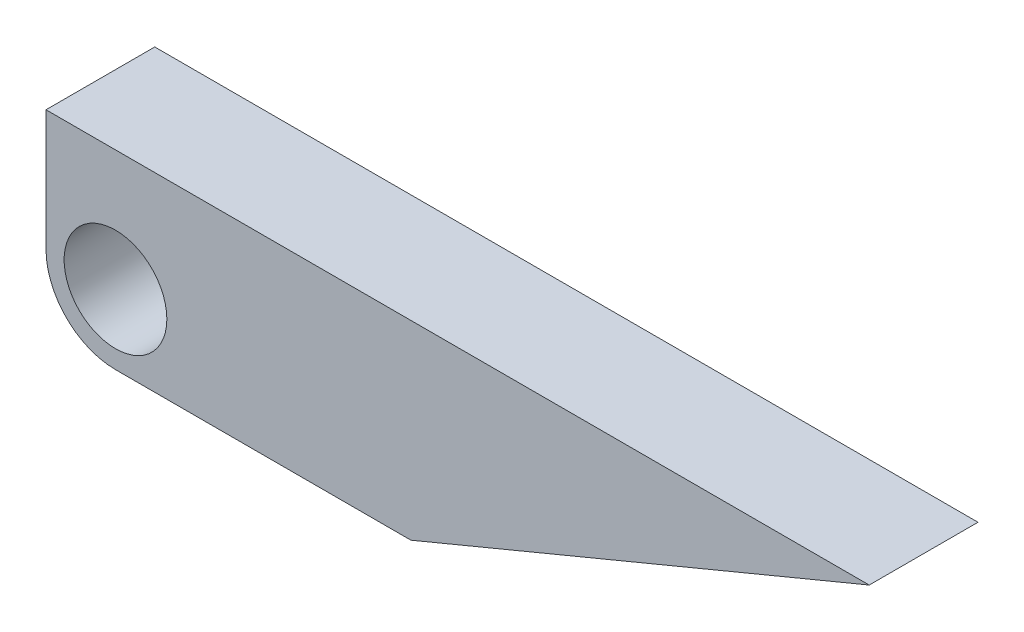
ISO-10303-21;
HEADER;
FILE_DESCRIPTION(('STEP AP214'),'2;1');
FILE_NAME('part.step','',(''),(''),'','','');
FILE_SCHEMA(('AUTOMOTIVE_DESIGN { 1 0 10303 214 1 1 1 1 }'));
ENDSEC;
DATA;
#1=APPLICATION_CONTEXT('core data for automotive mechanical design processes');
#2=APPLICATION_PROTOCOL_DEFINITION('international standard','automotive_design',2000,#1);
#3=PRODUCT_CONTEXT('',#1,'mechanical');
#4=PRODUCT('Part','Part','',(#3));
#5=PRODUCT_RELATED_PRODUCT_CATEGORY('part','',(#4));
#6=PRODUCT_DEFINITION_FORMATION('','',#4);
#7=PRODUCT_DEFINITION_CONTEXT('part definition',#1,'design');
#8=PRODUCT_DEFINITION('design','',#6,#7);
#9=PRODUCT_DEFINITION_SHAPE('','',#8);
#10=(LENGTH_UNIT() NAMED_UNIT(*) SI_UNIT(.MILLI.,.METRE.));
#11=(NAMED_UNIT(*) PLANE_ANGLE_UNIT() SI_UNIT($,.RADIAN.));
#12=(NAMED_UNIT(*) SI_UNIT($,.STERADIAN.) SOLID_ANGLE_UNIT());
#13=UNCERTAINTY_MEASURE_WITH_UNIT(LENGTH_MEASURE(1.E-05),#10,'distance_accuracy_value','');
#14=(GEOMETRIC_REPRESENTATION_CONTEXT(3) GLOBAL_UNCERTAINTY_ASSIGNED_CONTEXT((#13)) GLOBAL_UNIT_ASSIGNED_CONTEXT((#10,
#11,#12)) REPRESENTATION_CONTEXT('',''));
#15=CARTESIAN_POINT('',(0.,0.,0.));
#16=DIRECTION('',(0.,0.,1.));
#17=DIRECTION('',(1.,0.,0.));
#18=AXIS2_PLACEMENT_3D('',#15,#16,#17);
#19=CARTESIAN_POINT('',(-1.15,0.,1.8));
#20=DIRECTION('',(-1.,0.,0.));
#21=DIRECTION('',(0.,0.,1.));
#22=AXIS2_PLACEMENT_3D('',#19,#20,#21);
#23=PLANE('',#22);
#24=DIRECTION('',(0.,1.,0.));
#25=VECTOR('',#24,1.);
#26=CARTESIAN_POINT('',(-1.15,0.,0.));
#27=LINE('',#26,#25);
#28=CARTESIAN_POINT('',(-1.15,0.,0.));
#29=VERTEX_POINT('',#28);
#30=CARTESIAN_POINT('',(-1.15,2.,0.));
#31=VERTEX_POINT('',#30);
#32=EDGE_CURVE('E115',#29,#31,#27,.T.);
#33=ORIENTED_EDGE('',*,*,#32,.F.);
#34=DIRECTION('',(0.,0.,-1.));
#35=VECTOR('',#34,1.);
#36=CARTESIAN_POINT('',(-1.15,0.,1.8));
#37=LINE('',#36,#35);
#38=CARTESIAN_POINT('',(-1.15,0.,1.8));
#39=VERTEX_POINT('',#38);
#40=EDGE_CURVE('E11',#39,#29,#37,.T.);
#41=ORIENTED_EDGE('',*,*,#40,.F.);
#42=DIRECTION('',(0.,1.,0.));
#43=VECTOR('',#42,1.);
#44=CARTESIAN_POINT('',(-1.15,0.,1.8));
#45=LINE('',#44,#43);
#46=CARTESIAN_POINT('',(-1.15,2.,1.8));
#47=VERTEX_POINT('',#46);
#48=EDGE_CURVE('E128',#39,#47,#45,.T.);
#49=ORIENTED_EDGE('',*,*,#48,.T.);
#50=DIRECTION('',(0.,0.,-1.));
#51=VECTOR('',#50,1.);
#52=CARTESIAN_POINT('',(-1.15,2.,1.8));
#53=LINE('',#52,#51);
#54=EDGE_CURVE('E53',#47,#31,#53,.T.);
#55=ORIENTED_EDGE('',*,*,#54,.T.);
#56=EDGE_LOOP('',(#33,#41,#49,#55));
#57=FACE_BOUND('',#56,.T.);
#58=ADVANCED_FACE('F37',(#57),#23,.T.);
#59=CARTESIAN_POINT('',(0.,0.,1.8));
#60=DIRECTION('',(0.,0.,-1.));
#61=DIRECTION('',(-1.,0.,0.));
#62=AXIS2_PLACEMENT_3D('',#59,#60,#61);
#63=CYLINDRICAL_SURFACE('',#62,1.15);
#64=CARTESIAN_POINT('',(0.,0.,0.));
#65=DIRECTION('',(0.,0.,1.));
#66=DIRECTION('',(1.,0.,0.));
#67=AXIS2_PLACEMENT_3D('',#64,#65,#66);
#68=CIRCLE('',#67,1.15);
#69=CARTESIAN_POINT('',(0.,-1.15,0.));
#70=VERTEX_POINT('',#69);
#71=EDGE_CURVE('E117',#29,#70,#68,.T.);
#72=ORIENTED_EDGE('',*,*,#71,.T.);
#73=DIRECTION('',(0.,0.,-1.));
#74=VECTOR('',#73,1.);
#75=CARTESIAN_POINT('',(0.,-1.15,1.8));
#76=LINE('',#75,#74);
#77=CARTESIAN_POINT('',(0.,-1.15,1.8));
#78=VERTEX_POINT('',#77);
#79=EDGE_CURVE('E45',#78,#70,#76,.T.);
#80=ORIENTED_EDGE('',*,*,#79,.F.);
#81=CARTESIAN_POINT('',(0.,0.,1.8));
#82=DIRECTION('',(0.,0.,1.));
#83=DIRECTION('',(1.,0.,0.));
#84=AXIS2_PLACEMENT_3D('',#81,#82,#83);
#85=CIRCLE('',#84,1.15);
#86=EDGE_CURVE('E93',#39,#78,#85,.T.);
#87=ORIENTED_EDGE('',*,*,#86,.F.);
#88=ORIENTED_EDGE('',*,*,#40,.T.);
#89=EDGE_LOOP('',(#72,#80,#87,#88));
#90=FACE_BOUND('',#89,.T.);
#91=ADVANCED_FACE('F147',(#90),#63,.T.);
#92=CARTESIAN_POINT('',(0.,-1.15,1.8));
#93=DIRECTION('',(0.,1.,0.));
#94=DIRECTION('',(0.,0.,1.));
#95=AXIS2_PLACEMENT_3D('',#92,#93,#94);
#96=PLANE('',#95);
#97=DIRECTION('',(1.,0.,0.));
#98=VECTOR('',#97,1.);
#99=CARTESIAN_POINT('',(0.,-1.15,0.));
#100=LINE('',#99,#98);
#101=CARTESIAN_POINT('',(4.88931637616474,-1.15,0.));
#102=VERTEX_POINT('',#101);
#103=EDGE_CURVE('E102',#70,#102,#100,.T.);
#104=ORIENTED_EDGE('',*,*,#103,.T.);
#105=DIRECTION('',(0.,0.,-1.));
#106=VECTOR('',#105,1.);
#107=CARTESIAN_POINT('',(4.88931637616474,-1.15,1.8));
#108=LINE('',#107,#106);
#109=CARTESIAN_POINT('',(4.88931637616474,-1.15,1.8));
#110=VERTEX_POINT('',#109);
#111=EDGE_CURVE('E99',#110,#102,#108,.T.);
#112=ORIENTED_EDGE('',*,*,#111,.F.);
#113=DIRECTION('',(1.,0.,0.));
#114=VECTOR('',#113,1.);
#115=CARTESIAN_POINT('',(0.,-1.15,1.8));
#116=LINE('',#115,#114);
#117=EDGE_CURVE('E85',#78,#110,#116,.T.);
#118=ORIENTED_EDGE('',*,*,#117,.F.);
#119=ORIENTED_EDGE('',*,*,#79,.T.);
#120=EDGE_LOOP('',(#104,#112,#118,#119));
#121=FACE_BOUND('',#120,.T.);
#122=ADVANCED_FACE('F100',(#121),#96,.F.);
#123=CARTESIAN_POINT('',(1.12643137890515,-2.71258198348616,1.8));
#124=DIRECTION('',(-0.383509505898259,0.923536928815342,0.));
#125=DIRECTION('',(-0.923536928815342,-0.383509505898259,0.));
#126=AXIS2_PLACEMENT_3D('',#123,#124,#125);
#127=PLANE('',#126);
#128=DIRECTION('',(0.923536928815342,0.383509505898259,0.));
#129=VECTOR('',#128,1.);
#130=CARTESIAN_POINT('',(1.12643137890515,-2.71258198348616,0.));
#131=LINE('',#130,#129);
#132=CARTESIAN_POINT('',(12.47489451967,2.,0.));
#133=VERTEX_POINT('',#132);
#134=EDGE_CURVE('E120',#102,#133,#131,.T.);
#135=ORIENTED_EDGE('',*,*,#134,.T.);
#136=DIRECTION('',(0.,0.,-1.));
#137=VECTOR('',#136,1.);
#138=CARTESIAN_POINT('',(12.47489451967,2.,1.8));
#139=LINE('',#138,#137);
#140=CARTESIAN_POINT('',(12.47489451967,2.,1.8));
#141=VERTEX_POINT('',#140);
#142=EDGE_CURVE('E70',#141,#133,#139,.T.);
#143=ORIENTED_EDGE('',*,*,#142,.F.);
#144=DIRECTION('',(0.923536928815342,0.383509505898259,0.));
#145=VECTOR('',#144,1.);
#146=CARTESIAN_POINT('',(1.12643137890515,-2.71258198348616,1.8));
#147=LINE('',#146,#145);
#148=EDGE_CURVE('E92',#110,#141,#147,.T.);
#149=ORIENTED_EDGE('',*,*,#148,.F.);
#150=ORIENTED_EDGE('',*,*,#111,.T.);
#151=EDGE_LOOP('',(#135,#143,#149,#150));
#152=FACE_BOUND('',#151,.T.);
#153=ADVANCED_FACE('F106',(#152),#127,.F.);
#154=CARTESIAN_POINT('',(0.,2.,1.8));
#155=DIRECTION('',(0.,1.,0.));
#156=DIRECTION('',(0.,0.,1.));
#157=AXIS2_PLACEMENT_3D('',#154,#155,#156);
#158=PLANE('',#157);
#159=DIRECTION('',(1.,0.,0.));
#160=VECTOR('',#159,1.);
#161=CARTESIAN_POINT('',(0.,2.,0.));
#162=LINE('',#161,#160);
#163=EDGE_CURVE('E122',#31,#133,#162,.T.);
#164=ORIENTED_EDGE('',*,*,#163,.F.);
#165=ORIENTED_EDGE('',*,*,#54,.F.);
#166=DIRECTION('',(1.,0.,0.));
#167=VECTOR('',#166,1.);
#168=CARTESIAN_POINT('',(0.,2.,1.8));
#169=LINE('',#168,#167);
#170=EDGE_CURVE('E107',#47,#141,#169,.T.);
#171=ORIENTED_EDGE('',*,*,#170,.T.);
#172=ORIENTED_EDGE('',*,*,#142,.T.);
#173=EDGE_LOOP('',(#164,#165,#171,#172));
#174=FACE_BOUND('',#173,.T.);
#175=ADVANCED_FACE('F135',(#174),#158,.T.);
#176=CARTESIAN_POINT('',(0.,0.,1.8));
#177=DIRECTION('',(0.,0.,-1.));
#178=DIRECTION('',(-1.,0.,0.));
#179=AXIS2_PLACEMENT_3D('',#176,#177,#178);
#180=CYLINDRICAL_SURFACE('',#179,0.85);
#181=CARTESIAN_POINT('',(0.,0.,1.8));
#182=DIRECTION('',(0.,0.,1.));
#183=DIRECTION('',(1.,0.,0.));
#184=AXIS2_PLACEMENT_3D('',#181,#182,#183);
#185=CIRCLE('',#184,0.85);
#186=CARTESIAN_POINT('',(0.85,0.,1.8));
#187=VERTEX_POINT('',#186);
#188=EDGE_CURVE('E109',#187,#187,#185,.T.);
#189=ORIENTED_EDGE('',*,*,#188,.T.);
#190=EDGE_LOOP('',(#189));
#191=FACE_BOUND('',#190,.T.);
#192=CARTESIAN_POINT('',(0.,0.,0.));
#193=DIRECTION('',(0.,0.,1.));
#194=DIRECTION('',(1.,0.,0.));
#195=AXIS2_PLACEMENT_3D('',#192,#193,#194);
#196=CIRCLE('',#195,0.85);
#197=CARTESIAN_POINT('',(0.85,0.,0.));
#198=VERTEX_POINT('',#197);
#199=EDGE_CURVE('E125',#198,#198,#196,.T.);
#200=ORIENTED_EDGE('',*,*,#199,.F.);
#201=EDGE_LOOP('',(#200));
#202=FACE_BOUND('',#201,.T.);
#203=ADVANCED_FACE('F137',(#191,#202),#180,.F.);
#204=CARTESIAN_POINT('',(0.,0.,1.8));
#205=DIRECTION('',(0.,0.,1.));
#206=DIRECTION('',(1.,0.,0.));
#207=AXIS2_PLACEMENT_3D('',#204,#205,#206);
#208=PLANE('',#207);
#209=ORIENTED_EDGE('',*,*,#48,.F.);
#210=ORIENTED_EDGE('',*,*,#86,.T.);
#211=ORIENTED_EDGE('',*,*,#117,.T.);
#212=ORIENTED_EDGE('',*,*,#148,.T.);
#213=ORIENTED_EDGE('',*,*,#170,.F.);
#214=EDGE_LOOP('',(#209,#210,#211,#212,#213));
#215=FACE_BOUND('',#214,.T.);
#216=ORIENTED_EDGE('',*,*,#188,.F.);
#217=EDGE_LOOP('',(#216));
#218=FACE_BOUND('',#217,.T.);
#219=ADVANCED_FACE('F88',(#215,#218),#208,.T.);
#220=CARTESIAN_POINT('',(0.,0.,0.));
#221=DIRECTION('',(0.,0.,1.));
#222=DIRECTION('',(1.,0.,0.));
#223=AXIS2_PLACEMENT_3D('',#220,#221,#222);
#224=PLANE('',#223);
#225=ORIENTED_EDGE('',*,*,#32,.T.);
#226=ORIENTED_EDGE('',*,*,#163,.T.);
#227=ORIENTED_EDGE('',*,*,#134,.F.);
#228=ORIENTED_EDGE('',*,*,#103,.F.);
#229=ORIENTED_EDGE('',*,*,#71,.F.);
#230=EDGE_LOOP('',(#225,#226,#227,#228,#229));
#231=FACE_BOUND('',#230,.T.);
#232=ORIENTED_EDGE('',*,*,#199,.T.);
#233=EDGE_LOOP('',(#232));
#234=FACE_BOUND('',#233,.T.);
#235=ADVANCED_FACE('F133',(#231,#234),#224,.F.);
#236=CLOSED_SHELL('',(#58,#91,#122,#153,#175,#203,#219,#235));
#237=MANIFOLD_SOLID_BREP('B2',#236);
#238=ADVANCED_BREP_SHAPE_REPRESENTATION('',(#18,#237),#14);
#239=SHAPE_DEFINITION_REPRESENTATION(#9,#238);
ENDSEC;
END-ISO-10303-21;
